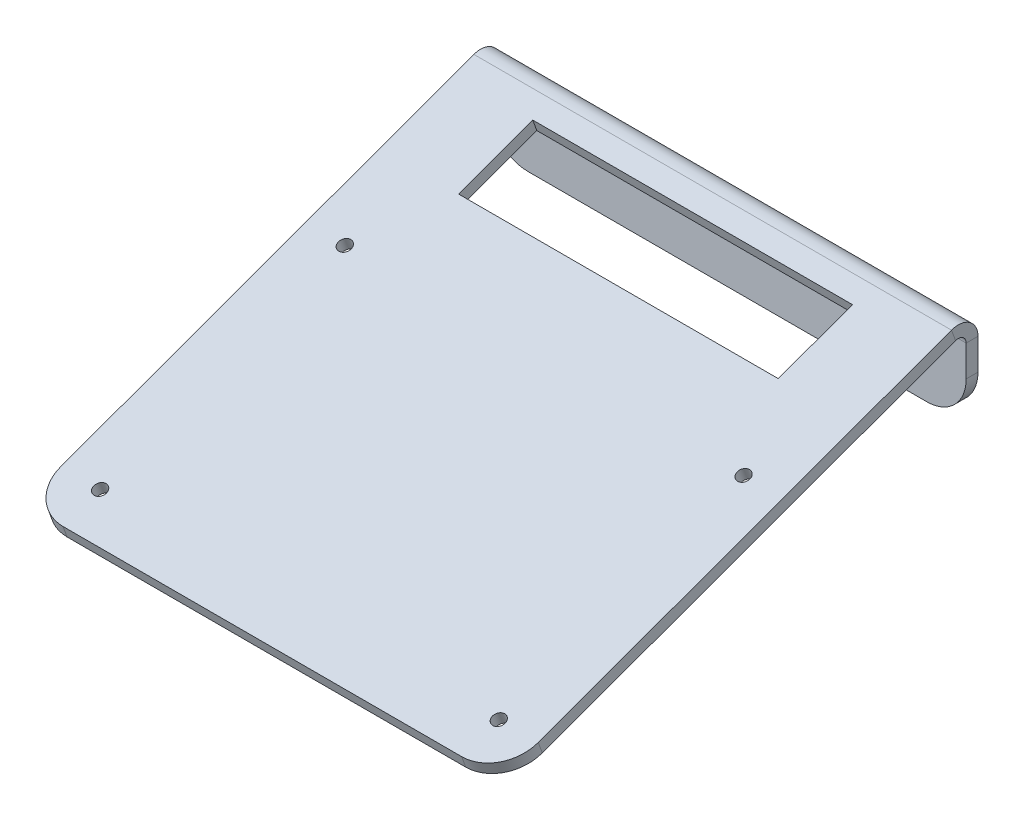
ISO-10303-21;
HEADER;
FILE_DESCRIPTION(('STEP AP214'),'2;1');
FILE_NAME('part.step','',(''),(''),'','','');
FILE_SCHEMA(('AUTOMOTIVE_DESIGN { 1 0 10303 214 1 1 1 1 }'));
ENDSEC;
DATA;
#1=APPLICATION_CONTEXT('core data for automotive mechanical design processes');
#2=APPLICATION_PROTOCOL_DEFINITION('international standard','automotive_design',2000,#1);
#3=PRODUCT_CONTEXT('',#1,'mechanical');
#4=PRODUCT('Part','Part','',(#3));
#5=PRODUCT_RELATED_PRODUCT_CATEGORY('part','',(#4));
#6=PRODUCT_DEFINITION_FORMATION('','',#4);
#7=PRODUCT_DEFINITION_CONTEXT('part definition',#1,'design');
#8=PRODUCT_DEFINITION('design','',#6,#7);
#9=PRODUCT_DEFINITION_SHAPE('','',#8);
#10=(LENGTH_UNIT() NAMED_UNIT(*) SI_UNIT(.MILLI.,.METRE.));
#11=(NAMED_UNIT(*) PLANE_ANGLE_UNIT() SI_UNIT($,.RADIAN.));
#12=(NAMED_UNIT(*) SI_UNIT($,.STERADIAN.) SOLID_ANGLE_UNIT());
#13=UNCERTAINTY_MEASURE_WITH_UNIT(LENGTH_MEASURE(1.E-05),#10,'distance_accuracy_value','');
#14=(GEOMETRIC_REPRESENTATION_CONTEXT(3) GLOBAL_UNCERTAINTY_ASSIGNED_CONTEXT((#13)) GLOBAL_UNIT_ASSIGNED_CONTEXT((#10,
#11,#12)) REPRESENTATION_CONTEXT('',''));
#15=CARTESIAN_POINT('',(0.,0.,0.));
#16=DIRECTION('',(0.,0.,1.));
#17=DIRECTION('',(1.,0.,0.));
#18=AXIS2_PLACEMENT_3D('',#15,#16,#17);
#19=CARTESIAN_POINT('',(0.,28.1450822407548,-17.4124556392903));
#20=DIRECTION('',(0.,0.939692620785907,0.342020143325673));
#21=DIRECTION('',(-1.,0.,0.));
#22=AXIS2_PLACEMENT_3D('',#19,#20,#21);
#23=PLANE('',#22);
#24=DIRECTION('',(1.,0.,0.));
#25=VECTOR('',#24,1.);
#26=CARTESIAN_POINT('',(20.0000000000051,17.8844779409844,10.7783229842874));
#27=LINE('',#26,#25);
#28=CARTESIAN_POINT('',(20.0000000000051,17.8844779409844,10.7783229842874));
#29=VERTEX_POINT('',#28);
#30=CARTESIAN_POINT('',(101.,17.8844779409844,10.7783229842874));
#31=VERTEX_POINT('',#30);
#32=EDGE_CURVE('E157',#29,#31,#27,.T.);
#33=ORIENTED_EDGE('',*,*,#32,.F.);
#34=DIRECTION('',(0.,0.342020143325673,-0.939692620785907));
#35=VECTOR('',#34,1.);
#36=CARTESIAN_POINT('',(20.0000000000051,11.0440750744692,29.5721754000103));
#37=LINE('',#36,#35);
#38=CARTESIAN_POINT('',(20.0000000000051,11.0440750744692,29.5721754000103));
#39=VERTEX_POINT('',#38);
#40=EDGE_CURVE('E305',#39,#29,#37,.T.);
#41=ORIENTED_EDGE('',*,*,#40,.F.);
#42=DIRECTION('',(-1.,0.,0.));
#43=VECTOR('',#42,1.);
#44=CARTESIAN_POINT('',(20.0000000000051,11.0440750744692,29.5721754000103));
#45=LINE('',#44,#43);
#46=CARTESIAN_POINT('',(101.,11.0440750744692,29.5721754000103));
#47=VERTEX_POINT('',#46);
#48=EDGE_CURVE('E308',#47,#39,#45,.T.);
#49=ORIENTED_EDGE('',*,*,#48,.F.);
#50=DIRECTION('',(0.,-0.342020143325673,0.939692620785907));
#51=VECTOR('',#50,1.);
#52=CARTESIAN_POINT('',(101.,11.0440750744692,29.5721754000103));
#53=LINE('',#52,#51);
#54=EDGE_CURVE('E311',#31,#47,#53,.T.);
#55=ORIENTED_EDGE('',*,*,#54,.F.);
#56=EDGE_LOOP('',(#33,#41,#49,#55));
#57=FACE_BOUND('',#56,.T.);
#58=CARTESIAN_POINT('',(110.999999999995,4.20367220795886,48.3660278157199));
#59=DIRECTION('',(0.,-0.939692620785907,-0.342020143325673));
#60=DIRECTION('',(1.,0.,0.));
#61=AXIS2_PLACEMENT_3D('',#58,#59,#60);
#62=CIRCLE('',#61,1.60000000000001);
#63=CARTESIAN_POINT('',(112.599999999995,4.20367220795886,48.3660278157199));
#64=VERTEX_POINT('',#63);
#65=EDGE_CURVE('E314',#64,#64,#62,.T.);
#66=ORIENTED_EDGE('',*,*,#65,.F.);
#67=EDGE_LOOP('',(#66));
#68=FACE_BOUND('',#67,.T.);
#69=CARTESIAN_POINT('',(110.999999999995,-18.369657251536,110.385740787591));
#70=DIRECTION('',(0.,-0.939692620785907,-0.342020143325673));
#71=DIRECTION('',(1.,0.,0.));
#72=AXIS2_PLACEMENT_3D('',#69,#70,#71);
#73=CIRCLE('',#72,1.6);
#74=CARTESIAN_POINT('',(112.599999999995,-18.369657251536,110.385740787591));
#75=VERTEX_POINT('',#74);
#76=EDGE_CURVE('E170',#75,#75,#73,.T.);
#77=ORIENTED_EDGE('',*,*,#76,.F.);
#78=EDGE_LOOP('',(#77));
#79=FACE_BOUND('',#78,.T.);
#80=CARTESIAN_POINT('',(10.,4.19163166380963,48.3991089388878));
#81=DIRECTION('',(0.,-0.939692620785907,-0.342020143325673));
#82=DIRECTION('',(1.,0.,0.));
#83=AXIS2_PLACEMENT_3D('',#80,#81,#82);
#84=CIRCLE('',#83,1.6);
#85=CARTESIAN_POINT('',(11.6,4.19163166380963,48.3991089388878));
#86=VERTEX_POINT('',#85);
#87=EDGE_CURVE('E165',#86,#86,#84,.T.);
#88=ORIENTED_EDGE('',*,*,#87,.F.);
#89=EDGE_LOOP('',(#88));
#90=FACE_BOUND('',#89,.T.);
#91=CARTESIAN_POINT('',(10.,-18.3696572515367,110.385740787593));
#92=DIRECTION('',(0.,-0.939692620785907,-0.342020143325673));
#93=DIRECTION('',(1.,0.,0.));
#94=AXIS2_PLACEMENT_3D('',#91,#92,#93);
#95=CIRCLE('',#94,1.6);
#96=CARTESIAN_POINT('',(11.6,-18.3696572515367,110.385740787593));
#97=VERTEX_POINT('',#96);
#98=EDGE_CURVE('E160',#97,#97,#95,.T.);
#99=ORIENTED_EDGE('',*,*,#98,.F.);
#100=EDGE_LOOP('',(#99));
#101=FACE_BOUND('',#100,.T.);
#102=DIRECTION('',(0.,0.342020143325673,-0.939692620785907));
#103=VECTOR('',#102,1.);
#104=CARTESIAN_POINT('',(0.,28.1450822407548,-17.4124556392903));
#105=LINE('',#104,#103);
#106=CARTESIAN_POINT('',(0.,-18.3696572515367,110.385740787593));
#107=VERTEX_POINT('',#106);
#108=CARTESIAN_POINT('',(0.,19.7386452078613,5.68404028665135));
#109=VERTEX_POINT('',#108);
#110=EDGE_CURVE('E44',#107,#109,#105,.T.);
#111=ORIENTED_EDGE('',*,*,#110,.T.);
#112=DIRECTION('',(1.,0.,0.));
#113=VECTOR('',#112,1.);
#114=CARTESIAN_POINT('',(0.,19.7386452078613,5.68404028665134));
#115=LINE('',#114,#113);
#116=CARTESIAN_POINT('',(121.,19.7386452078613,5.68404028665135));
#117=VERTEX_POINT('',#116);
#118=EDGE_CURVE('E146',#109,#117,#115,.T.);
#119=ORIENTED_EDGE('',*,*,#118,.T.);
#120=DIRECTION('',(0.,-0.342020143325673,0.939692620785907));
#121=VECTOR('',#120,1.);
#122=CARTESIAN_POINT('',(121.,28.1450822407548,-17.4124556392903));
#123=LINE('',#122,#121);
#124=CARTESIAN_POINT('',(121.,-18.3696572515367,110.385740787593));
#125=VERTEX_POINT('',#124);
#126=EDGE_CURVE('E158',#117,#125,#123,.T.);
#127=ORIENTED_EDGE('',*,*,#126,.T.);
#128=CARTESIAN_POINT('',(111.,-18.3696572515367,110.385740787593));
#129=DIRECTION('',(0.,0.939692620785907,0.342020143325673));
#130=DIRECTION('',(-1.,0.,0.));
#131=AXIS2_PLACEMENT_3D('',#128,#129,#130);
#132=CIRCLE('',#131,10.);
#133=CARTESIAN_POINT('',(111.,-21.7898586847934,119.782666995452));
#134=VERTEX_POINT('',#133);
#135=EDGE_CURVE('E117',#125,#134,#132,.F.);
#136=ORIENTED_EDGE('',*,*,#135,.T.);
#137=DIRECTION('',(-1.,0.,0.));
#138=VECTOR('',#137,1.);
#139=CARTESIAN_POINT('',(0.,-21.7898586847934,119.782666995452));
#140=LINE('',#139,#138);
#141=CARTESIAN_POINT('',(10.,-21.7898586847934,119.782666995452));
#142=VERTEX_POINT('',#141);
#143=EDGE_CURVE('E162',#134,#142,#140,.T.);
#144=ORIENTED_EDGE('',*,*,#143,.T.);
#145=CARTESIAN_POINT('',(10.,-18.3696572515367,110.385740787593));
#146=DIRECTION('',(0.,0.939692620785907,0.342020143325673));
#147=DIRECTION('',(-1.,0.,0.));
#148=AXIS2_PLACEMENT_3D('',#145,#146,#147);
#149=CIRCLE('',#148,10.);
#150=EDGE_CURVE('E176',#142,#107,#149,.F.);
#151=ORIENTED_EDGE('',*,*,#150,.T.);
#152=EDGE_LOOP('',(#111,#119,#127,#136,#144,#151));
#153=FACE_BOUND('',#152,.T.);
#154=ADVANCED_FACE('F40',(#57,#68,#79,#90,#101,#153),#23,.F.);
#155=CARTESIAN_POINT('',(0.,-21.7898586847934,119.782666995452));
#156=DIRECTION('',(0.,0.342020143325673,-0.939692620785907));
#157=DIRECTION('',(-1.,0.,0.));
#158=AXIS2_PLACEMENT_3D('',#155,#156,#157);
#159=PLANE('',#158);
#160=DIRECTION('',(0.,-0.939692620785907,-0.342020143325673));
#161=VECTOR('',#160,1.);
#162=CARTESIAN_POINT('',(111.,-21.7898586847934,119.782666995452));
#163=LINE('',#162,#161);
#164=CARTESIAN_POINT('',(111.,-18.9707808224357,120.808727425429));
#165=VERTEX_POINT('',#164);
#166=EDGE_CURVE('E145',#165,#134,#163,.T.);
#167=ORIENTED_EDGE('',*,*,#166,.F.);
#168=DIRECTION('',(-1.,0.,0.));
#169=VECTOR('',#168,1.);
#170=CARTESIAN_POINT('',(0.,-18.9707808224357,120.808727425429));
#171=LINE('',#170,#169);
#172=CARTESIAN_POINT('',(10.,-18.9707808224357,120.808727425429));
#173=VERTEX_POINT('',#172);
#174=EDGE_CURVE('E125',#165,#173,#171,.T.);
#175=ORIENTED_EDGE('',*,*,#174,.T.);
#176=DIRECTION('',(0.,-0.939692620785907,-0.342020143325673));
#177=VECTOR('',#176,1.);
#178=CARTESIAN_POINT('',(10.,-21.7898586847934,119.782666995452));
#179=LINE('',#178,#177);
#180=EDGE_CURVE('E143',#173,#142,#179,.T.);
#181=ORIENTED_EDGE('',*,*,#180,.T.);
#182=ORIENTED_EDGE('',*,*,#143,.F.);
#183=EDGE_LOOP('',(#167,#175,#181,#182));
#184=FACE_BOUND('',#183,.T.);
#185=ADVANCED_FACE('F204',(#184),#159,.F.);
#186=CARTESIAN_POINT('',(10.,-18.3696572515367,110.385740787593));
#187=DIRECTION('',(0.,0.939692620785907,0.342020143325673));
#188=DIRECTION('',(-1.,0.,0.));
#189=AXIS2_PLACEMENT_3D('',#186,#187,#188);
#190=CYLINDRICAL_SURFACE('',#189,10.);
#191=ORIENTED_EDGE('',*,*,#180,.F.);
#192=CARTESIAN_POINT('',(10.,-15.550579389179,111.41180121757));
#193=DIRECTION('',(0.,0.939692620785907,0.342020143325673));
#194=DIRECTION('',(-1.,0.,0.));
#195=AXIS2_PLACEMENT_3D('',#192,#193,#194);
#196=CIRCLE('',#195,10.);
#197=CARTESIAN_POINT('',(0.,-15.550579389179,111.41180121757));
#198=VERTEX_POINT('',#197);
#199=EDGE_CURVE('E127',#173,#198,#196,.F.);
#200=ORIENTED_EDGE('',*,*,#199,.T.);
#201=DIRECTION('',(0.,-0.939692620785907,-0.342020143325673));
#202=VECTOR('',#201,1.);
#203=CARTESIAN_POINT('',(0.,-18.3696572515367,110.385740787593));
#204=LINE('',#203,#202);
#205=EDGE_CURVE('E65',#198,#107,#204,.T.);
#206=ORIENTED_EDGE('',*,*,#205,.T.);
#207=ORIENTED_EDGE('',*,*,#150,.F.);
#208=EDGE_LOOP('',(#191,#200,#206,#207));
#209=FACE_BOUND('',#208,.T.);
#210=ADVANCED_FACE('F201',(#209),#190,.T.);
#211=CARTESIAN_POINT('',(0.,28.1450822407548,-17.4124556392903));
#212=DIRECTION('',(1.,0.,0.));
#213=DIRECTION('',(0.,0.342020143325673,-0.939692620785907));
#214=AXIS2_PLACEMENT_3D('',#211,#212,#213);
#215=PLANE('',#214);
#216=DIRECTION('',(0.,0.939692620785905,0.342020143325679));
#217=VECTOR('',#216,1.);
#218=CARTESIAN_POINT('',(0.,19.7386452078611,5.68404028665128));
#219=LINE('',#218,#217);
#220=CARTESIAN_POINT('',(0.,22.557723070219,6.71010071662838));
#221=VERTEX_POINT('',#220);
#222=EDGE_CURVE('E150',#109,#221,#219,.T.);
#223=ORIENTED_EDGE('',*,*,#222,.F.);
#224=ORIENTED_EDGE('',*,*,#110,.F.);
#225=ORIENTED_EDGE('',*,*,#205,.F.);
#226=DIRECTION('',(0.,-0.342020143325673,0.939692620785907));
#227=VECTOR('',#226,1.);
#228=CARTESIAN_POINT('',(0.,30.9641601031125,-16.3863952093133));
#229=LINE('',#228,#227);
#230=EDGE_CURVE('E155',#198,#221,#229,.F.);
#231=ORIENTED_EDGE('',*,*,#230,.T.);
#232=EDGE_LOOP('',(#223,#224,#225,#231));
#233=FACE_BOUND('',#232,.T.);
#234=ADVANCED_FACE('F211',(#233),#215,.F.);
#235=CARTESIAN_POINT('',(121.,28.1450822407548,-17.4124556392903));
#236=DIRECTION('',(-1.,0.,0.));
#237=DIRECTION('',(0.,-0.342020143325673,0.939692620785907));
#238=AXIS2_PLACEMENT_3D('',#235,#236,#237);
#239=PLANE('',#238);
#240=DIRECTION('',(0.,-0.939692620785905,-0.342020143325679));
#241=VECTOR('',#240,1.);
#242=CARTESIAN_POINT('',(121.,19.7386452078611,5.68404028665128));
#243=LINE('',#242,#241);
#244=CARTESIAN_POINT('',(121.,22.557723070219,6.71010071662838));
#245=VERTEX_POINT('',#244);
#246=EDGE_CURVE('E12',#245,#117,#243,.T.);
#247=ORIENTED_EDGE('',*,*,#246,.F.);
#248=DIRECTION('',(0.,-0.342020143325673,0.939692620785907));
#249=VECTOR('',#248,1.);
#250=CARTESIAN_POINT('',(121.,30.9641601031125,-16.3863952093133));
#251=LINE('',#250,#249);
#252=CARTESIAN_POINT('',(121.,-15.550579389179,111.41180121757));
#253=VERTEX_POINT('',#252);
#254=EDGE_CURVE('E99',#245,#253,#251,.T.);
#255=ORIENTED_EDGE('',*,*,#254,.T.);
#256=DIRECTION('',(0.,-0.939692620785907,-0.342020143325673));
#257=VECTOR('',#256,1.);
#258=CARTESIAN_POINT('',(121.,-18.3696572515367,110.385740787593));
#259=LINE('',#258,#257);
#260=EDGE_CURVE('E103',#253,#125,#259,.T.);
#261=ORIENTED_EDGE('',*,*,#260,.T.);
#262=ORIENTED_EDGE('',*,*,#126,.F.);
#263=EDGE_LOOP('',(#247,#255,#261,#262));
#264=FACE_BOUND('',#263,.T.);
#265=ADVANCED_FACE('F42',(#264),#239,.F.);
#266=CARTESIAN_POINT('',(20.0000000000051,11.0440750744692,29.5721754000103));
#267=DIRECTION('',(0.,0.342020143325673,-0.939692620785907));
#268=DIRECTION('',(-1.,0.,0.));
#269=AXIS2_PLACEMENT_3D('',#266,#267,#268);
#270=PLANE('',#269);
#271=DIRECTION('',(0.,-0.939692620785907,-0.342020143325673));
#272=VECTOR('',#271,1.);
#273=CARTESIAN_POINT('',(20.0000000000051,11.0440750744692,29.5721754000103));
#274=LINE('',#273,#272);
#275=CARTESIAN_POINT('',(20.0000000000051,13.8631529368269,30.5982358299874));
#276=VERTEX_POINT('',#275);
#277=EDGE_CURVE('E118',#276,#39,#274,.T.);
#278=ORIENTED_EDGE('',*,*,#277,.F.);
#279=DIRECTION('',(-1.,0.,0.));
#280=VECTOR('',#279,1.);
#281=CARTESIAN_POINT('',(0.,13.8631529368269,30.5982358299874));
#282=LINE('',#281,#280);
#283=CARTESIAN_POINT('',(101.,13.8631529368269,30.5982358299874));
#284=VERTEX_POINT('',#283);
#285=EDGE_CURVE('E187',#284,#276,#282,.T.);
#286=ORIENTED_EDGE('',*,*,#285,.F.);
#287=DIRECTION('',(0.,-0.939692620785907,-0.342020143325673));
#288=VECTOR('',#287,1.);
#289=CARTESIAN_POINT('',(101.,11.0440750744692,29.5721754000103));
#290=LINE('',#289,#288);
#291=EDGE_CURVE('E134',#284,#47,#290,.T.);
#292=ORIENTED_EDGE('',*,*,#291,.T.);
#293=ORIENTED_EDGE('',*,*,#48,.T.);
#294=EDGE_LOOP('',(#278,#286,#292,#293));
#295=FACE_BOUND('',#294,.T.);
#296=ADVANCED_FACE('F357',(#295),#270,.T.);
#297=CARTESIAN_POINT('',(101.,11.0440750744692,29.5721754000103));
#298=DIRECTION('',(-1.,0.,0.));
#299=DIRECTION('',(0.,-0.342020143325673,0.939692620785907));
#300=AXIS2_PLACEMENT_3D('',#297,#298,#299);
#301=PLANE('',#300);
#302=ORIENTED_EDGE('',*,*,#291,.F.);
#303=DIRECTION('',(0.,-0.342020143325673,0.939692620785907));
#304=VECTOR('',#303,1.);
#305=CARTESIAN_POINT('',(101.,30.9641601031125,-16.3863952093133));
#306=LINE('',#305,#304);
#307=CARTESIAN_POINT('',(101.,20.7035558033421,11.8043834142644));
#308=VERTEX_POINT('',#307);
#309=EDGE_CURVE('E183',#308,#284,#306,.T.);
#310=ORIENTED_EDGE('',*,*,#309,.F.);
#311=DIRECTION('',(0.,-0.939692620785907,-0.342020143325673));
#312=VECTOR('',#311,1.);
#313=CARTESIAN_POINT('',(101.,17.8844779409844,10.7783229842874));
#314=LINE('',#313,#312);
#315=EDGE_CURVE('E131',#308,#31,#314,.T.);
#316=ORIENTED_EDGE('',*,*,#315,.T.);
#317=ORIENTED_EDGE('',*,*,#54,.T.);
#318=EDGE_LOOP('',(#302,#310,#316,#317));
#319=FACE_BOUND('',#318,.T.);
#320=ADVANCED_FACE('F361',(#319),#301,.T.);
#321=CARTESIAN_POINT('',(20.0000000000051,17.8844779409844,10.7783229842874));
#322=DIRECTION('',(0.,-0.342020143325673,0.939692620785907));
#323=DIRECTION('',(1.,0.,0.));
#324=AXIS2_PLACEMENT_3D('',#321,#322,#323);
#325=PLANE('',#324);
#326=ORIENTED_EDGE('',*,*,#315,.F.);
#327=DIRECTION('',(-1.,0.,0.));
#328=VECTOR('',#327,1.);
#329=CARTESIAN_POINT('',(0.,20.7035558033421,11.8043834142644));
#330=LINE('',#329,#328);
#331=CARTESIAN_POINT('',(20.0000000000051,20.7035558033421,11.8043834142644));
#332=VERTEX_POINT('',#331);
#333=EDGE_CURVE('E178',#332,#308,#330,.F.);
#334=ORIENTED_EDGE('',*,*,#333,.F.);
#335=DIRECTION('',(0.,-0.939692620785907,-0.342020143325673));
#336=VECTOR('',#335,1.);
#337=CARTESIAN_POINT('',(20.0000000000051,17.8844779409844,10.7783229842874));
#338=LINE('',#337,#336);
#339=EDGE_CURVE('E135',#332,#29,#338,.T.);
#340=ORIENTED_EDGE('',*,*,#339,.T.);
#341=ORIENTED_EDGE('',*,*,#32,.T.);
#342=EDGE_LOOP('',(#326,#334,#340,#341));
#343=FACE_BOUND('',#342,.T.);
#344=ADVANCED_FACE('F367',(#343),#325,.T.);
#345=CARTESIAN_POINT('',(20.0000000000051,11.0440750744692,29.5721754000103));
#346=DIRECTION('',(1.,0.,0.));
#347=DIRECTION('',(0.,0.342020143325673,-0.939692620785907));
#348=AXIS2_PLACEMENT_3D('',#345,#346,#347);
#349=PLANE('',#348);
#350=DIRECTION('',(0.,-0.342020143325673,0.939692620785907));
#351=VECTOR('',#350,1.);
#352=CARTESIAN_POINT('',(20.0000000000051,30.9641601031125,-16.3863952093133));
#353=LINE('',#352,#351);
#354=EDGE_CURVE('E181',#276,#332,#353,.F.);
#355=ORIENTED_EDGE('',*,*,#354,.F.);
#356=ORIENTED_EDGE('',*,*,#277,.T.);
#357=ORIENTED_EDGE('',*,*,#40,.T.);
#358=ORIENTED_EDGE('',*,*,#339,.F.);
#359=EDGE_LOOP('',(#355,#356,#357,#358));
#360=FACE_BOUND('',#359,.T.);
#361=ADVANCED_FACE('F372',(#360),#349,.T.);
#362=CARTESIAN_POINT('',(110.999999999995,4.20367220795886,48.3660278157199));
#363=DIRECTION('',(0.,-0.939692620785907,-0.342020143325673));
#364=DIRECTION('',(1.,0.,0.));
#365=AXIS2_PLACEMENT_3D('',#362,#363,#364);
#366=CYLINDRICAL_SURFACE('',#365,1.60000000000001);
#367=ORIENTED_EDGE('',*,*,#65,.T.);
#368=EDGE_LOOP('',(#367));
#369=FACE_BOUND('',#368,.T.);
#370=CARTESIAN_POINT('',(110.999999999995,7.02275007031658,49.3920882456969));
#371=DIRECTION('',(0.,-0.939692620785907,-0.342020143325673));
#372=DIRECTION('',(1.,0.,0.));
#373=AXIS2_PLACEMENT_3D('',#370,#371,#372);
#374=CIRCLE('',#373,1.60000000000001);
#375=CARTESIAN_POINT('',(112.599999999995,7.02275007031658,49.3920882456969));
#376=VERTEX_POINT('',#375);
#377=EDGE_CURVE('E186',#376,#376,#374,.T.);
#378=ORIENTED_EDGE('',*,*,#377,.F.);
#379=EDGE_LOOP('',(#378));
#380=FACE_BOUND('',#379,.T.);
#381=ADVANCED_FACE('F375',(#369,#380),#366,.F.);
#382=CARTESIAN_POINT('',(110.999999999995,-18.369657251536,110.385740787591));
#383=DIRECTION('',(0.,-0.939692620785907,-0.342020143325673));
#384=DIRECTION('',(1.,0.,0.));
#385=AXIS2_PLACEMENT_3D('',#382,#383,#384);
#386=CYLINDRICAL_SURFACE('',#385,1.6);
#387=ORIENTED_EDGE('',*,*,#76,.T.);
#388=EDGE_LOOP('',(#387));
#389=FACE_BOUND('',#388,.T.);
#390=CARTESIAN_POINT('',(110.999999999995,-15.5505793891783,111.411801217568));
#391=DIRECTION('',(0.,-0.939692620785907,-0.342020143325673));
#392=DIRECTION('',(1.,0.,0.));
#393=AXIS2_PLACEMENT_3D('',#390,#391,#392);
#394=CIRCLE('',#393,1.6);
#395=CARTESIAN_POINT('',(112.599999999995,-15.5505793891783,111.411801217568));
#396=VERTEX_POINT('',#395);
#397=EDGE_CURVE('E194',#396,#396,#394,.T.);
#398=ORIENTED_EDGE('',*,*,#397,.F.);
#399=EDGE_LOOP('',(#398));
#400=FACE_BOUND('',#399,.T.);
#401=ADVANCED_FACE('F319',(#389,#400),#386,.F.);
#402=CARTESIAN_POINT('',(10.,4.19163166380963,48.3991089388878));
#403=DIRECTION('',(0.,-0.939692620785907,-0.342020143325673));
#404=DIRECTION('',(1.,0.,0.));
#405=AXIS2_PLACEMENT_3D('',#402,#403,#404);
#406=CYLINDRICAL_SURFACE('',#405,1.6);
#407=ORIENTED_EDGE('',*,*,#87,.T.);
#408=EDGE_LOOP('',(#407));
#409=FACE_BOUND('',#408,.T.);
#410=CARTESIAN_POINT('',(10.,7.01070952616735,49.4251693688649));
#411=DIRECTION('',(0.,-0.939692620785907,-0.342020143325673));
#412=DIRECTION('',(1.,0.,0.));
#413=AXIS2_PLACEMENT_3D('',#410,#411,#412);
#414=CIRCLE('',#413,1.6);
#415=CARTESIAN_POINT('',(11.6,7.01070952616735,49.4251693688649));
#416=VERTEX_POINT('',#415);
#417=EDGE_CURVE('E197',#416,#416,#414,.T.);
#418=ORIENTED_EDGE('',*,*,#417,.F.);
#419=EDGE_LOOP('',(#418));
#420=FACE_BOUND('',#419,.T.);
#421=ADVANCED_FACE('F329',(#409,#420),#406,.F.);
#422=CARTESIAN_POINT('',(10.,-18.3696572515367,110.385740787593));
#423=DIRECTION('',(0.,-0.939692620785907,-0.342020143325673));
#424=DIRECTION('',(1.,0.,0.));
#425=AXIS2_PLACEMENT_3D('',#422,#423,#424);
#426=CYLINDRICAL_SURFACE('',#425,1.6);
#427=ORIENTED_EDGE('',*,*,#98,.T.);
#428=EDGE_LOOP('',(#427));
#429=FACE_BOUND('',#428,.T.);
#430=CARTESIAN_POINT('',(10.,-15.550579389179,111.41180121757));
#431=DIRECTION('',(0.,-0.939692620785907,-0.342020143325673));
#432=DIRECTION('',(1.,0.,0.));
#433=AXIS2_PLACEMENT_3D('',#430,#431,#432);
#434=CIRCLE('',#433,1.6);
#435=CARTESIAN_POINT('',(11.6,-15.550579389179,111.41180121757));
#436=VERTEX_POINT('',#435);
#437=EDGE_CURVE('E110',#436,#436,#434,.T.);
#438=ORIENTED_EDGE('',*,*,#437,.F.);
#439=EDGE_LOOP('',(#438));
#440=FACE_BOUND('',#439,.T.);
#441=ADVANCED_FACE('F332',(#429,#440),#426,.F.);
#442=CARTESIAN_POINT('',(111.,-18.3696572515367,110.385740787593));
#443=DIRECTION('',(0.,0.939692620785907,0.342020143325673));
#444=DIRECTION('',(-1.,0.,0.));
#445=AXIS2_PLACEMENT_3D('',#442,#443,#444);
#446=CYLINDRICAL_SURFACE('',#445,10.);
#447=CARTESIAN_POINT('',(111.,-15.550579389179,111.41180121757));
#448=DIRECTION('',(0.,0.939692620785907,0.342020143325673));
#449=DIRECTION('',(-1.,0.,0.));
#450=AXIS2_PLACEMENT_3D('',#447,#448,#449);
#451=CIRCLE('',#450,10.);
#452=EDGE_CURVE('E109',#253,#165,#451,.F.);
#453=ORIENTED_EDGE('',*,*,#452,.T.);
#454=ORIENTED_EDGE('',*,*,#166,.T.);
#455=ORIENTED_EDGE('',*,*,#135,.F.);
#456=ORIENTED_EDGE('',*,*,#260,.F.);
#457=EDGE_LOOP('',(#453,#454,#455,#456));
#458=FACE_BOUND('',#457,.T.);
#459=ADVANCED_FACE('F114',(#458),#446,.T.);
#460=CARTESIAN_POINT('',(0.,30.9641601031125,-16.3863952093133));
#461=DIRECTION('',(0.,0.939692620785907,0.342020143325673));
#462=DIRECTION('',(-1.,0.,0.));
#463=AXIS2_PLACEMENT_3D('',#460,#461,#462);
#464=PLANE('',#463);
#465=DIRECTION('',(1.,0.,0.));
#466=VECTOR('',#465,1.);
#467=CARTESIAN_POINT('',(0.,22.557723070219,6.71010071662838));
#468=LINE('',#467,#466);
#469=EDGE_CURVE('E49',#221,#245,#468,.T.);
#470=ORIENTED_EDGE('',*,*,#469,.F.);
#471=ORIENTED_EDGE('',*,*,#230,.F.);
#472=ORIENTED_EDGE('',*,*,#199,.F.);
#473=ORIENTED_EDGE('',*,*,#174,.F.);
#474=ORIENTED_EDGE('',*,*,#452,.F.);
#475=ORIENTED_EDGE('',*,*,#254,.F.);
#476=EDGE_LOOP('',(#470,#471,#472,#473,#474,#475));
#477=FACE_BOUND('',#476,.T.);
#478=ORIENTED_EDGE('',*,*,#333,.T.);
#479=ORIENTED_EDGE('',*,*,#309,.T.);
#480=ORIENTED_EDGE('',*,*,#285,.T.);
#481=ORIENTED_EDGE('',*,*,#354,.T.);
#482=EDGE_LOOP('',(#478,#479,#480,#481));
#483=FACE_BOUND('',#482,.T.);
#484=ORIENTED_EDGE('',*,*,#377,.T.);
#485=EDGE_LOOP('',(#484));
#486=FACE_BOUND('',#485,.T.);
#487=ORIENTED_EDGE('',*,*,#397,.T.);
#488=EDGE_LOOP('',(#487));
#489=FACE_BOUND('',#488,.T.);
#490=ORIENTED_EDGE('',*,*,#417,.T.);
#491=EDGE_LOOP('',(#490));
#492=FACE_BOUND('',#491,.T.);
#493=ORIENTED_EDGE('',*,*,#437,.T.);
#494=EDGE_LOOP('',(#493));
#495=FACE_BOUND('',#494,.T.);
#496=ADVANCED_FACE('F121',(#477,#483,#486,#489,#492,#495),#464,.T.);
#497=CARTESIAN_POINT('',(110.999999999995,9.99999999999545,3.));
#498=DIRECTION('',(0.,0.,1.));
#499=DIRECTION('',(1.,0.,0.));
#500=AXIS2_PLACEMENT_3D('',#497,#498,#499);
#501=CYLINDRICAL_SURFACE('',#500,1.6);
#502=CARTESIAN_POINT('',(110.999999999995,9.99999999999545,3.));
#503=DIRECTION('',(0.,0.,1.));
#504=DIRECTION('',(1.,0.,0.));
#505=AXIS2_PLACEMENT_3D('',#502,#503,#504);
#506=CIRCLE('',#505,1.6);
#507=CARTESIAN_POINT('',(112.599999999995,9.99999999999545,3.));
#508=VERTEX_POINT('',#507);
#509=EDGE_CURVE('E298',#508,#508,#506,.T.);
#510=ORIENTED_EDGE('',*,*,#509,.T.);
#511=EDGE_LOOP('',(#510));
#512=FACE_BOUND('',#511,.T.);
#513=CARTESIAN_POINT('',(110.999999999995,9.99999999999545,0.));
#514=DIRECTION('',(0.,0.,1.));
#515=DIRECTION('',(1.,0.,0.));
#516=AXIS2_PLACEMENT_3D('',#513,#514,#515);
#517=CIRCLE('',#516,1.6);
#518=CARTESIAN_POINT('',(112.599999999995,9.99999999999545,0.));
#519=VERTEX_POINT('',#518);
#520=EDGE_CURVE('E250',#519,#519,#517,.T.);
#521=ORIENTED_EDGE('',*,*,#520,.F.);
#522=EDGE_LOOP('',(#521));
#523=FACE_BOUND('',#522,.T.);
#524=ADVANCED_FACE('F338',(#512,#523),#501,.F.);
#525=CARTESIAN_POINT('',(9.99999999999545,9.99999999999545,3.));
#526=DIRECTION('',(0.,0.,1.));
#527=DIRECTION('',(1.,0.,0.));
#528=AXIS2_PLACEMENT_3D('',#525,#526,#527);
#529=CYLINDRICAL_SURFACE('',#528,1.6);
#530=CARTESIAN_POINT('',(9.99999999999545,9.99999999999545,3.));
#531=DIRECTION('',(0.,0.,1.));
#532=DIRECTION('',(1.,0.,0.));
#533=AXIS2_PLACEMENT_3D('',#530,#531,#532);
#534=CIRCLE('',#533,1.6);
#535=CARTESIAN_POINT('',(11.5999999999955,9.99999999999545,3.));
#536=VERTEX_POINT('',#535);
#537=EDGE_CURVE('E295',#536,#536,#534,.T.);
#538=ORIENTED_EDGE('',*,*,#537,.T.);
#539=EDGE_LOOP('',(#538));
#540=FACE_BOUND('',#539,.T.);
#541=CARTESIAN_POINT('',(9.99999999999545,9.99999999999545,0.));
#542=DIRECTION('',(0.,0.,1.));
#543=DIRECTION('',(1.,0.,0.));
#544=AXIS2_PLACEMENT_3D('',#541,#542,#543);
#545=CIRCLE('',#544,1.6);
#546=CARTESIAN_POINT('',(11.5999999999955,9.99999999999545,0.));
#547=VERTEX_POINT('',#546);
#548=EDGE_CURVE('E247',#547,#547,#545,.T.);
#549=ORIENTED_EDGE('',*,*,#548,.F.);
#550=EDGE_LOOP('',(#549));
#551=FACE_BOUND('',#550,.T.);
#552=ADVANCED_FACE('F419',(#540,#551),#529,.F.);
#553=CARTESIAN_POINT('',(111.,10.,3.));
#554=DIRECTION('',(0.,0.,-1.));
#555=DIRECTION('',(-1.,0.,0.));
#556=AXIS2_PLACEMENT_3D('',#553,#554,#555);
#557=CYLINDRICAL_SURFACE('',#556,10.);
#558=DIRECTION('',(0.,0.,1.));
#559=VECTOR('',#558,1.);
#560=CARTESIAN_POINT('',(111.,0.,3.));
#561=LINE('',#560,#559);
#562=CARTESIAN_POINT('',(111.,0.,0.));
#563=VERTEX_POINT('',#562);
#564=CARTESIAN_POINT('',(111.,0.,3.));
#565=VERTEX_POINT('',#564);
#566=EDGE_CURVE('E283',#563,#565,#561,.T.);
#567=ORIENTED_EDGE('',*,*,#566,.F.);
#568=CARTESIAN_POINT('',(111.,10.,0.));
#569=DIRECTION('',(0.,0.,-1.));
#570=DIRECTION('',(-1.,0.,0.));
#571=AXIS2_PLACEMENT_3D('',#568,#569,#570);
#572=CIRCLE('',#571,10.);
#573=CARTESIAN_POINT('',(121.,10.,0.));
#574=VERTEX_POINT('',#573);
#575=EDGE_CURVE('E292',#563,#574,#572,.F.);
#576=ORIENTED_EDGE('',*,*,#575,.T.);
#577=DIRECTION('',(0.,0.,1.));
#578=VECTOR('',#577,1.);
#579=CARTESIAN_POINT('',(121.,10.,3.));
#580=LINE('',#579,#578);
#581=CARTESIAN_POINT('',(121.,10.,3.));
#582=VERTEX_POINT('',#581);
#583=EDGE_CURVE('E289',#574,#582,#580,.T.);
#584=ORIENTED_EDGE('',*,*,#583,.T.);
#585=CARTESIAN_POINT('',(111.,10.,3.));
#586=DIRECTION('',(0.,0.,-1.));
#587=DIRECTION('',(-1.,0.,0.));
#588=AXIS2_PLACEMENT_3D('',#585,#586,#587);
#589=CIRCLE('',#588,10.);
#590=EDGE_CURVE('E265',#565,#582,#589,.F.);
#591=ORIENTED_EDGE('',*,*,#590,.F.);
#592=EDGE_LOOP('',(#567,#576,#584,#591));
#593=FACE_BOUND('',#592,.T.);
#594=ADVANCED_FACE('F430',(#593),#557,.T.);
#595=CARTESIAN_POINT('',(0.,0.,3.));
#596=DIRECTION('',(0.,1.,0.));
#597=DIRECTION('',(1.,0.,0.));
#598=AXIS2_PLACEMENT_3D('',#595,#596,#597);
#599=PLANE('',#598);
#600=DIRECTION('',(0.,0.,1.));
#601=VECTOR('',#600,1.);
#602=CARTESIAN_POINT('',(10.,0.,3.));
#603=LINE('',#602,#601);
#604=CARTESIAN_POINT('',(10.,0.,0.));
#605=VERTEX_POINT('',#604);
#606=CARTESIAN_POINT('',(10.,0.,3.));
#607=VERTEX_POINT('',#606);
#608=EDGE_CURVE('E277',#605,#607,#603,.T.);
#609=ORIENTED_EDGE('',*,*,#608,.F.);
#610=DIRECTION('',(-1.,0.,0.));
#611=VECTOR('',#610,1.);
#612=CARTESIAN_POINT('',(0.,0.,0.));
#613=LINE('',#612,#611);
#614=EDGE_CURVE('E286',#605,#563,#613,.F.);
#615=ORIENTED_EDGE('',*,*,#614,.T.);
#616=ORIENTED_EDGE('',*,*,#566,.T.);
#617=DIRECTION('',(1.,0.,0.));
#618=VECTOR('',#617,1.);
#619=CARTESIAN_POINT('',(0.,0.,3.));
#620=LINE('',#619,#618);
#621=EDGE_CURVE('E268',#607,#565,#620,.T.);
#622=ORIENTED_EDGE('',*,*,#621,.F.);
#623=EDGE_LOOP('',(#609,#615,#616,#622));
#624=FACE_BOUND('',#623,.T.);
#625=ADVANCED_FACE('F441',(#624),#599,.F.);
#626=CARTESIAN_POINT('',(10.,10.,3.));
#627=DIRECTION('',(0.,0.,-1.));
#628=DIRECTION('',(-1.,0.,0.));
#629=AXIS2_PLACEMENT_3D('',#626,#627,#628);
#630=CYLINDRICAL_SURFACE('',#629,10.);
#631=DIRECTION('',(0.,0.,1.));
#632=VECTOR('',#631,1.);
#633=CARTESIAN_POINT('',(0.,10.,3.));
#634=LINE('',#633,#632);
#635=CARTESIAN_POINT('',(0.,10.,0.));
#636=VERTEX_POINT('',#635);
#637=CARTESIAN_POINT('',(0.,10.,3.));
#638=VERTEX_POINT('',#637);
#639=EDGE_CURVE('E253',#636,#638,#634,.T.);
#640=ORIENTED_EDGE('',*,*,#639,.F.);
#641=CARTESIAN_POINT('',(10.,10.,0.));
#642=DIRECTION('',(0.,0.,-1.));
#643=DIRECTION('',(-1.,0.,0.));
#644=AXIS2_PLACEMENT_3D('',#641,#642,#643);
#645=CIRCLE('',#644,10.);
#646=EDGE_CURVE('E280',#636,#605,#645,.F.);
#647=ORIENTED_EDGE('',*,*,#646,.T.);
#648=ORIENTED_EDGE('',*,*,#608,.T.);
#649=CARTESIAN_POINT('',(10.,10.,3.));
#650=DIRECTION('',(0.,0.,-1.));
#651=DIRECTION('',(-1.,0.,0.));
#652=AXIS2_PLACEMENT_3D('',#649,#650,#651);
#653=CIRCLE('',#652,10.);
#654=EDGE_CURVE('E271',#638,#607,#653,.F.);
#655=ORIENTED_EDGE('',*,*,#654,.F.);
#656=EDGE_LOOP('',(#640,#647,#648,#655));
#657=FACE_BOUND('',#656,.T.);
#658=ADVANCED_FACE('F452',(#657),#630,.T.);
#659=CARTESIAN_POINT('',(0.,0.,3.));
#660=DIRECTION('',(0.,0.,-1.));
#661=DIRECTION('',(-1.,0.,0.));
#662=AXIS2_PLACEMENT_3D('',#659,#660,#661);
#663=PLANE('',#662);
#664=DIRECTION('',(1.,0.,0.));
#665=VECTOR('',#664,1.);
#666=CARTESIAN_POINT('',(0.,17.8592599662895,3.));
#667=LINE('',#666,#665);
#668=CARTESIAN_POINT('',(0.,17.8592599662895,3.));
#669=VERTEX_POINT('',#668);
#670=CARTESIAN_POINT('',(121.,17.8592599662895,3.));
#671=VERTEX_POINT('',#670);
#672=EDGE_CURVE('E301',#669,#671,#667,.T.);
#673=ORIENTED_EDGE('',*,*,#672,.F.);
#674=DIRECTION('',(0.,-1.,0.));
#675=VECTOR('',#674,1.);
#676=CARTESIAN_POINT('',(0.,0.,3.));
#677=LINE('',#676,#675);
#678=EDGE_CURVE('E274',#669,#638,#677,.T.);
#679=ORIENTED_EDGE('',*,*,#678,.T.);
#680=ORIENTED_EDGE('',*,*,#654,.T.);
#681=ORIENTED_EDGE('',*,*,#621,.T.);
#682=ORIENTED_EDGE('',*,*,#590,.T.);
#683=DIRECTION('',(0.,1.,0.));
#684=VECTOR('',#683,1.);
#685=CARTESIAN_POINT('',(121.,0.,3.));
#686=LINE('',#685,#684);
#687=EDGE_CURVE('E262',#582,#671,#686,.T.);
#688=ORIENTED_EDGE('',*,*,#687,.T.);
#689=EDGE_LOOP('',(#673,#679,#680,#681,#682,#688));
#690=FACE_BOUND('',#689,.T.);
#691=ORIENTED_EDGE('',*,*,#537,.F.);
#692=EDGE_LOOP('',(#691));
#693=FACE_BOUND('',#692,.T.);
#694=ORIENTED_EDGE('',*,*,#509,.F.);
#695=EDGE_LOOP('',(#694));
#696=FACE_BOUND('',#695,.T.);
#697=ADVANCED_FACE('F463',(#690,#693,#696),#663,.F.);
#698=CARTESIAN_POINT('',(0.,0.,3.));
#699=DIRECTION('',(1.,0.,0.));
#700=DIRECTION('',(0.,-1.,0.));
#701=AXIS2_PLACEMENT_3D('',#698,#699,#700);
#702=PLANE('',#701);
#703=ORIENTED_EDGE('',*,*,#678,.F.);
#704=DIRECTION('',(0.,0.,-1.));
#705=VECTOR('',#704,1.);
#706=CARTESIAN_POINT('',(0.,17.8592599662895,3.00000000000012));
#707=LINE('',#706,#705);
#708=CARTESIAN_POINT('',(0.,17.8592599662895,0.));
#709=VERTEX_POINT('',#708);
#710=EDGE_CURVE('E259',#669,#709,#707,.T.);
#711=ORIENTED_EDGE('',*,*,#710,.T.);
#712=DIRECTION('',(0.,1.,0.));
#713=VECTOR('',#712,1.);
#714=CARTESIAN_POINT('',(0.,0.,0.));
#715=LINE('',#714,#713);
#716=EDGE_CURVE('E256',#709,#636,#715,.F.);
#717=ORIENTED_EDGE('',*,*,#716,.T.);
#718=ORIENTED_EDGE('',*,*,#639,.T.);
#719=EDGE_LOOP('',(#703,#711,#717,#718));
#720=FACE_BOUND('',#719,.T.);
#721=ADVANCED_FACE('F474',(#720),#702,.F.);
#722=CARTESIAN_POINT('',(0.,0.,0.));
#723=DIRECTION('',(0.,0.,-1.));
#724=DIRECTION('',(-1.,0.,0.));
#725=AXIS2_PLACEMENT_3D('',#722,#723,#724);
#726=PLANE('',#725);
#727=ORIENTED_EDGE('',*,*,#520,.T.);
#728=EDGE_LOOP('',(#727));
#729=FACE_BOUND('',#728,.T.);
#730=ORIENTED_EDGE('',*,*,#548,.T.);
#731=EDGE_LOOP('',(#730));
#732=FACE_BOUND('',#731,.T.);
#733=ORIENTED_EDGE('',*,*,#716,.F.);
#734=DIRECTION('',(1.,0.,0.));
#735=VECTOR('',#734,1.);
#736=CARTESIAN_POINT('',(0.,17.8592599662895,0.));
#737=LINE('',#736,#735);
#738=CARTESIAN_POINT('',(121.,17.8592599662895,0.));
#739=VERTEX_POINT('',#738);
#740=EDGE_CURVE('E233',#709,#739,#737,.T.);
#741=ORIENTED_EDGE('',*,*,#740,.T.);
#742=DIRECTION('',(0.,1.,0.));
#743=VECTOR('',#742,1.);
#744=CARTESIAN_POINT('',(121.,0.,0.));
#745=LINE('',#744,#743);
#746=EDGE_CURVE('E243',#574,#739,#745,.T.);
#747=ORIENTED_EDGE('',*,*,#746,.F.);
#748=ORIENTED_EDGE('',*,*,#575,.F.);
#749=ORIENTED_EDGE('',*,*,#614,.F.);
#750=ORIENTED_EDGE('',*,*,#646,.F.);
#751=EDGE_LOOP('',(#733,#741,#747,#748,#749,#750));
#752=FACE_BOUND('',#751,.T.);
#753=ADVANCED_FACE('F486',(#729,#732,#752),#726,.T.);
#754=CARTESIAN_POINT('',(121.,0.,3.));
#755=DIRECTION('',(-1.,0.,0.));
#756=DIRECTION('',(0.,1.,0.));
#757=AXIS2_PLACEMENT_3D('',#754,#755,#756);
#758=PLANE('',#757);
#759=ORIENTED_EDGE('',*,*,#746,.T.);
#760=DIRECTION('',(0.,0.,1.));
#761=VECTOR('',#760,1.);
#762=CARTESIAN_POINT('',(121.,17.8592599662895,3.00000000000012));
#763=LINE('',#762,#761);
#764=EDGE_CURVE('E182',#739,#671,#763,.T.);
#765=ORIENTED_EDGE('',*,*,#764,.T.);
#766=ORIENTED_EDGE('',*,*,#687,.F.);
#767=ORIENTED_EDGE('',*,*,#583,.F.);
#768=EDGE_LOOP('',(#759,#765,#766,#767));
#769=FACE_BOUND('',#768,.T.);
#770=ADVANCED_FACE('F495',(#769),#758,.F.);
#771=CARTESIAN_POINT('',(0.,17.8592599662895,5.));
#772=DIRECTION('',(1.,0.,0.));
#773=DIRECTION('',(0.,0.,-1.));
#774=AXIS2_PLACEMENT_3D('',#771,#772,#773);
#775=PLANE('',#774);
#776=ORIENTED_EDGE('',*,*,#222,.T.);
#777=CARTESIAN_POINT('',(0.,17.8592599662895,5.));
#778=DIRECTION('',(-1.,0.,0.));
#779=DIRECTION('',(0.,0.,1.));
#780=AXIS2_PLACEMENT_3D('',#777,#778,#779);
#781=CIRCLE('',#780,5.);
#782=EDGE_CURVE('E223',#221,#709,#781,.T.);
#783=ORIENTED_EDGE('',*,*,#782,.T.);
#784=ORIENTED_EDGE('',*,*,#710,.F.);
#785=CARTESIAN_POINT('',(0.,17.8592599662895,5.));
#786=DIRECTION('',(-1.,0.,0.));
#787=DIRECTION('',(0.,0.,1.));
#788=AXIS2_PLACEMENT_3D('',#785,#786,#787);
#789=CIRCLE('',#788,2.);
#790=EDGE_CURVE('E226',#109,#669,#789,.T.);
#791=ORIENTED_EDGE('',*,*,#790,.F.);
#792=EDGE_LOOP('',(#776,#783,#784,#791));
#793=FACE_BOUND('',#792,.T.);
#794=ADVANCED_FACE('F220',(#793),#775,.F.);
#795=CARTESIAN_POINT('',(121.,17.8592599662895,5.));
#796=DIRECTION('',(-1.,0.,0.));
#797=DIRECTION('',(0.,0.,1.));
#798=AXIS2_PLACEMENT_3D('',#795,#796,#797);
#799=PLANE('',#798);
#800=CARTESIAN_POINT('',(121.,17.8592599662895,5.));
#801=DIRECTION('',(-1.,0.,0.));
#802=DIRECTION('',(0.,0.,1.));
#803=AXIS2_PLACEMENT_3D('',#800,#801,#802);
#804=CIRCLE('',#803,5.);
#805=EDGE_CURVE('E235',#739,#245,#804,.F.);
#806=ORIENTED_EDGE('',*,*,#805,.T.);
#807=ORIENTED_EDGE('',*,*,#246,.T.);
#808=CARTESIAN_POINT('',(121.,17.8592599662895,5.));
#809=DIRECTION('',(1.,0.,0.));
#810=DIRECTION('',(0.,0.,-1.));
#811=AXIS2_PLACEMENT_3D('',#808,#809,#810);
#812=CIRCLE('',#811,2.);
#813=EDGE_CURVE('E57',#671,#117,#812,.T.);
#814=ORIENTED_EDGE('',*,*,#813,.F.);
#815=ORIENTED_EDGE('',*,*,#764,.F.);
#816=EDGE_LOOP('',(#806,#807,#814,#815));
#817=FACE_BOUND('',#816,.T.);
#818=ADVANCED_FACE('F514',(#817),#799,.F.);
#819=CARTESIAN_POINT('',(181.723561723981,17.8592599662895,5.));
#820=DIRECTION('',(-1.,0.,0.));
#821=DIRECTION('',(0.,0.,1.));
#822=AXIS2_PLACEMENT_3D('',#819,#820,#821);
#823=CYLINDRICAL_SURFACE('',#822,2.);
#824=ORIENTED_EDGE('',*,*,#672,.T.);
#825=ORIENTED_EDGE('',*,*,#813,.T.);
#826=ORIENTED_EDGE('',*,*,#118,.F.);
#827=ORIENTED_EDGE('',*,*,#790,.T.);
#828=EDGE_LOOP('',(#824,#825,#826,#827));
#829=FACE_BOUND('',#828,.T.);
#830=ADVANCED_FACE('F523',(#829),#823,.F.);
#831=CARTESIAN_POINT('',(181.723561723981,17.8592599662895,5.));
#832=DIRECTION('',(-1.,0.,0.));
#833=DIRECTION('',(0.,0.,1.));
#834=AXIS2_PLACEMENT_3D('',#831,#832,#833);
#835=CYLINDRICAL_SURFACE('',#834,5.);
#836=ORIENTED_EDGE('',*,*,#740,.F.);
#837=ORIENTED_EDGE('',*,*,#782,.F.);
#838=ORIENTED_EDGE('',*,*,#469,.T.);
#839=ORIENTED_EDGE('',*,*,#805,.F.);
#840=EDGE_LOOP('',(#836,#837,#838,#839));
#841=FACE_BOUND('',#840,.T.);
#842=ADVANCED_FACE('F229',(#841),#835,.T.);
#843=CLOSED_SHELL('',(#154,#185,#210,#234,#265,#296,#320,#344,#361,#381,#401,#421,#441,#459,
#496,#524,#552,#594,#625,#658,#697,#721,#753,#770,#794,#818,#830,#842));
#844=MANIFOLD_SOLID_BREP('B2',#843);
#845=ADVANCED_BREP_SHAPE_REPRESENTATION('',(#18,#844),#14);
#846=SHAPE_DEFINITION_REPRESENTATION(#9,#845);
ENDSEC;
END-ISO-10303-21;
